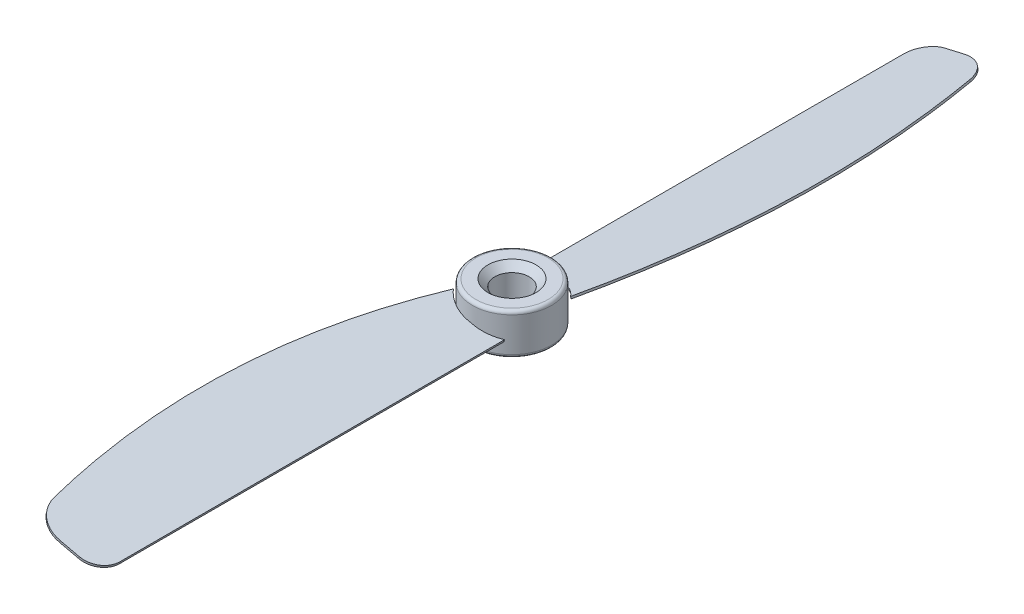
ISO-10303-21;
HEADER;
FILE_DESCRIPTION(('STEP AP214'),'2;1');
FILE_NAME('part.step','',(''),(''),'','','');
FILE_SCHEMA(('AUTOMOTIVE_DESIGN { 1 0 10303 214 1 1 1 1 }'));
ENDSEC;
DATA;
#1=APPLICATION_CONTEXT('core data for automotive mechanical design processes');
#2=APPLICATION_PROTOCOL_DEFINITION('international standard','automotive_design',2000,#1);
#3=PRODUCT_CONTEXT('',#1,'mechanical');
#4=PRODUCT('Part','Part','',(#3));
#5=PRODUCT_RELATED_PRODUCT_CATEGORY('part','',(#4));
#6=PRODUCT_DEFINITION_FORMATION('','',#4);
#7=PRODUCT_DEFINITION_CONTEXT('part definition',#1,'design');
#8=PRODUCT_DEFINITION('design','',#6,#7);
#9=PRODUCT_DEFINITION_SHAPE('','',#8);
#10=(LENGTH_UNIT() NAMED_UNIT(*) SI_UNIT(.MILLI.,.METRE.));
#11=(NAMED_UNIT(*) PLANE_ANGLE_UNIT() SI_UNIT($,.RADIAN.));
#12=(NAMED_UNIT(*) SI_UNIT($,.STERADIAN.) SOLID_ANGLE_UNIT());
#13=UNCERTAINTY_MEASURE_WITH_UNIT(LENGTH_MEASURE(1.E-05),#10,'distance_accuracy_value','');
#14=(GEOMETRIC_REPRESENTATION_CONTEXT(3) GLOBAL_UNCERTAINTY_ASSIGNED_CONTEXT((#13)) GLOBAL_UNIT_ASSIGNED_CONTEXT((#10,
#11,#12)) REPRESENTATION_CONTEXT('',''));
#15=CARTESIAN_POINT('',(0.,0.,0.));
#16=DIRECTION('',(0.,0.,1.));
#17=DIRECTION('',(1.,0.,0.));
#18=AXIS2_PLACEMENT_3D('',#15,#16,#17);
#19=CARTESIAN_POINT('',(0.,3.,0.));
#20=DIRECTION('',(0.,-1.,0.));
#21=DIRECTION('',(0.,0.,-1.));
#22=AXIS2_PLACEMENT_3D('',#19,#20,#21);
#23=CYLINDRICAL_SURFACE('',#22,5.75);
#24=CARTESIAN_POINT('',(0.,-2.5,0.));
#25=DIRECTION('',(0.,1.,0.));
#26=DIRECTION('',(0.,0.,1.));
#27=AXIS2_PLACEMENT_3D('',#24,#25,#26);
#28=CIRCLE('',#27,5.75);
#29=CARTESIAN_POINT('',(0.,-2.5,5.75));
#30=VERTEX_POINT('',#29);
#31=EDGE_CURVE('E335',#30,#30,#28,.T.);
#32=ORIENTED_EDGE('',*,*,#31,.T.);
#33=EDGE_LOOP('',(#32));
#34=FACE_BOUND('',#33,.T.);
#35=CARTESIAN_POINT('',(0.,2.5,0.));
#36=DIRECTION('',(0.,1.,0.));
#37=DIRECTION('',(0.,0.,1.));
#38=AXIS2_PLACEMENT_3D('',#35,#36,#37);
#39=CIRCLE('',#38,5.75);
#40=CARTESIAN_POINT('',(0.,2.5,5.75));
#41=VERTEX_POINT('',#40);
#42=EDGE_CURVE('E331',#41,#41,#39,.F.);
#43=ORIENTED_EDGE('',*,*,#42,.T.);
#44=EDGE_LOOP('',(#43));
#45=FACE_BOUND('',#44,.T.);
#46=CARTESIAN_POINT('',(0.,-15.7517323902207,0.));
#47=DIRECTION('',(0.974370064785235,0.224951054343866,0.));
#48=DIRECTION('',(0.224951054343866,-0.974370064785235,0.));
#49=AXIS2_PLACEMENT_3D('',#46,#47,#48);
#50=ELLIPSE('',#49,25.5611160248683,5.75);
#51=CARTESIAN_POINT('',(-3.41880983775629,-0.943240059214085,-4.6232282328759));
#52=VERTEX_POINT('',#51);
#53=CARTESIAN_POINT('',(-3.48629515405945,-0.650929039778514,-4.57255356434253));
#54=VERTEX_POINT('',#53);
#55=EDGE_CURVE('E69',#52,#54,#50,.T.);
#56=ORIENTED_EDGE('',*,*,#55,.F.);
#57=CARTESIAN_POINT('',(0.,-0.153945616169009,0.));
#58=DIRECTION('',(0.224951054343866,-0.974370064785235,0.));
#59=DIRECTION('',(-0.974370064785235,-0.224951054343866,0.));
#60=AXIS2_PLACEMENT_3D('',#57,#58,#59);
#61=ELLIPSE('',#60,5.901248619812,5.75);
#62=CARTESIAN_POINT('',(0.354622157582455,-0.0720746401149025,-5.73905420129055));
#63=VERTEX_POINT('',#62);
#64=EDGE_CURVE('E64',#52,#63,#61,.T.);
#65=ORIENTED_EDGE('',*,*,#64,.T.);
#66=CARTESIAN_POINT('',(0.354622157582455,-0.0720746401149025,-5.73905420129055));
#67=CARTESIAN_POINT('',(0.348852411202001,-0.0220916056182409,-5.73941071685678));
#68=CARTESIAN_POINT('',(0.343082658076224,0.0278914873125843,-5.7397585033949));
#69=CARTESIAN_POINT('',(0.331543138334024,0.127857790042562,-5.74043661841496));
#70=CARTESIAN_POINT('',(0.325773371717602,0.177840999841714,-5.74076694689688));
#71=CARTESIAN_POINT('',(0.320003598355857,0.227824268075029,-5.74108854635071));
#72=B_SPLINE_CURVE_WITH_KNOTS('',3,(#66,#67,#68,#69,#70,#71),.UNSPECIFIED.,.F.,.F.,(4,2,4),(0.,
0.150948617979298,0.301897235958597),.UNSPECIFIED.);
#73=CARTESIAN_POINT('',(0.320003598355995,0.227824268075136,-5.74108854635071));
#74=VERTEX_POINT('',#73);
#75=EDGE_CURVE('E154',#63,#74,#72,.T.);
#76=ORIENTED_EDGE('',*,*,#75,.T.);
#77=CARTESIAN_POINT('',(0.,0.153945616169009,0.));
#78=DIRECTION('',(0.224951054343866,-0.974370064785235,0.));
#79=DIRECTION('',(-0.974370064785235,-0.224951054343866,0.));
#80=AXIS2_PLACEMENT_3D('',#77,#78,#79);
#81=ELLIPSE('',#80,5.901248619812,5.75);
#82=EDGE_CURVE('E395',#54,#74,#81,.T.);
#83=ORIENTED_EDGE('',*,*,#82,.F.);
#84=EDGE_LOOP('',(#56,#65,#76,#83));
#85=FACE_BOUND('',#84,.T.);
#86=CARTESIAN_POINT('',(0.,-15.7517323902207,0.));
#87=DIRECTION('',(-0.974370064785235,0.224951054343866,0.));
#88=DIRECTION('',(-0.224951054343866,-0.974370064785235,0.));
#89=AXIS2_PLACEMENT_3D('',#86,#87,#88);
#90=ELLIPSE('',#89,25.5611160248683,5.75);
#91=CARTESIAN_POINT('',(3.41880983775629,-0.943240059214085,4.6232282328759));
#92=VERTEX_POINT('',#91);
#93=CARTESIAN_POINT('',(3.48629515405945,-0.650929039778514,4.57255356434253));
#94=VERTEX_POINT('',#93);
#95=EDGE_CURVE('E299',#92,#94,#90,.T.);
#96=ORIENTED_EDGE('',*,*,#95,.F.);
#97=CARTESIAN_POINT('',(0.,-0.153945616169009,0.));
#98=DIRECTION('',(-0.224951054343866,-0.974370064785235,0.));
#99=DIRECTION('',(0.974370064785235,-0.224951054343866,0.));
#100=AXIS2_PLACEMENT_3D('',#97,#98,#99);
#101=ELLIPSE('',#100,5.901248619812,5.75);
#102=CARTESIAN_POINT('',(-0.354622157582455,-0.0720746401149025,5.73905420129055));
#103=VERTEX_POINT('',#102);
#104=EDGE_CURVE('E310',#92,#103,#101,.T.);
#105=ORIENTED_EDGE('',*,*,#104,.T.);
#106=CARTESIAN_POINT('',(-0.354622157582455,-0.0720746401149025,5.73905420129055));
#107=CARTESIAN_POINT('',(-0.348852411202001,-0.0220916056182409,5.73941071685678));
#108=CARTESIAN_POINT('',(-0.343082658076224,0.0278914873125843,5.7397585033949));
#109=CARTESIAN_POINT('',(-0.331543138334024,0.127857790042562,5.74043661841496));
#110=CARTESIAN_POINT('',(-0.325773371717602,0.177840999841714,5.74076694689688));
#111=CARTESIAN_POINT('',(-0.320003598355857,0.227824268075029,5.74108854635071));
#112=B_SPLINE_CURVE_WITH_KNOTS('',3,(#106,#107,#108,#109,#110,#111),.UNSPECIFIED.,.F.,.F.,(4,2,
4),(0.,0.150948617979298,0.301897235958597),.UNSPECIFIED.);
#113=CARTESIAN_POINT('',(-0.320003598355995,0.227824268075136,5.74108854635071));
#114=VERTEX_POINT('',#113);
#115=EDGE_CURVE('E302',#103,#114,#112,.T.);
#116=ORIENTED_EDGE('',*,*,#115,.T.);
#117=CARTESIAN_POINT('',(0.,0.153945616169009,0.));
#118=DIRECTION('',(-0.224951054343866,-0.974370064785235,0.));
#119=DIRECTION('',(0.974370064785235,-0.224951054343866,0.));
#120=AXIS2_PLACEMENT_3D('',#117,#118,#119);
#121=ELLIPSE('',#120,5.901248619812,5.75);
#122=EDGE_CURVE('E295',#94,#114,#121,.T.);
#123=ORIENTED_EDGE('',*,*,#122,.F.);
#124=EDGE_LOOP('',(#96,#105,#116,#123));
#125=FACE_BOUND('',#124,.T.);
#126=ADVANCED_FACE('F47',(#34,#45,#85,#125),#23,.T.);
#127=CARTESIAN_POINT('',(0.,3.,0.));
#128=DIRECTION('',(0.,1.,0.));
#129=DIRECTION('',(0.,0.,1.));
#130=AXIS2_PLACEMENT_3D('',#127,#128,#129);
#131=PLANE('',#130);
#132=CARTESIAN_POINT('',(0.,3.,0.));
#133=DIRECTION('',(0.,1.,0.));
#134=DIRECTION('',(0.,0.,1.));
#135=AXIS2_PLACEMENT_3D('',#132,#133,#134);
#136=CIRCLE('',#135,3.50000000000002);
#137=CARTESIAN_POINT('',(0.,3.,3.50000000000002));
#138=VERTEX_POINT('',#137);
#139=EDGE_CURVE('E57',#138,#138,#136,.F.);
#140=ORIENTED_EDGE('',*,*,#139,.T.);
#141=EDGE_LOOP('',(#140));
#142=FACE_BOUND('',#141,.T.);
#143=CARTESIAN_POINT('',(0.,3.,0.));
#144=DIRECTION('',(0.,1.,0.));
#145=DIRECTION('',(0.,0.,1.));
#146=AXIS2_PLACEMENT_3D('',#143,#144,#145);
#147=CIRCLE('',#146,5.25);
#148=CARTESIAN_POINT('',(0.,3.,5.25));
#149=VERTEX_POINT('',#148);
#150=EDGE_CURVE('E343',#149,#149,#147,.T.);
#151=ORIENTED_EDGE('',*,*,#150,.T.);
#152=EDGE_LOOP('',(#151));
#153=FACE_BOUND('',#152,.T.);
#154=ADVANCED_FACE('F316',(#142,#153),#131,.T.);
#155=CARTESIAN_POINT('',(0.,-3.,0.));
#156=DIRECTION('',(0.,1.,0.));
#157=DIRECTION('',(0.,0.,1.));
#158=AXIS2_PLACEMENT_3D('',#155,#156,#157);
#159=PLANE('',#158);
#160=CARTESIAN_POINT('',(0.,-3.,0.));
#161=DIRECTION('',(0.,1.,0.));
#162=DIRECTION('',(0.,0.,1.));
#163=AXIS2_PLACEMENT_3D('',#160,#161,#162);
#164=CIRCLE('',#163,3.5);
#165=CARTESIAN_POINT('',(0.,-3.,3.5));
#166=VERTEX_POINT('',#165);
#167=EDGE_CURVE('E11',#166,#166,#164,.T.);
#168=ORIENTED_EDGE('',*,*,#167,.T.);
#169=EDGE_LOOP('',(#168));
#170=FACE_BOUND('',#169,.T.);
#171=CARTESIAN_POINT('',(0.,-3.,0.));
#172=DIRECTION('',(0.,1.,0.));
#173=DIRECTION('',(0.,0.,1.));
#174=AXIS2_PLACEMENT_3D('',#171,#172,#173);
#175=CIRCLE('',#174,5.25);
#176=CARTESIAN_POINT('',(0.,-3.,5.25));
#177=VERTEX_POINT('',#176);
#178=EDGE_CURVE('E339',#177,#177,#175,.F.);
#179=ORIENTED_EDGE('',*,*,#178,.T.);
#180=EDGE_LOOP('',(#179));
#181=FACE_BOUND('',#180,.T.);
#182=ADVANCED_FACE('F226',(#170,#181),#159,.F.);
#183=CARTESIAN_POINT('',(-0.691299378335197,0.00565342083347212,0.));
#184=DIRECTION('',(-0.224951054343866,-0.974370064785235,0.));
#185=DIRECTION('',(0.,0.,1.));
#186=AXIS2_PLACEMENT_3D('',#183,#184,#185);
#187=ELLIPSE('',#186,5.75,5.6026278725151);
#188=DIRECTION('',(0.224951054343866,0.974370064785235,0.));
#189=VECTOR('',#188,1.);
#190=SURFACE_OF_LINEAR_EXTRUSION('',#187,#189);
#191=ORIENTED_EDGE('',*,*,#115,.F.);
#192=CARTESIAN_POINT('',(-4.80140859442668,0.954546900881022,3.78427181784123));
#193=VERTEX_POINT('',#192);
#194=EDGE_CURVE('E231',#103,#193,#187,.T.);
#195=ORIENTED_EDGE('',*,*,#194,.T.);
#196=DIRECTION('',(0.224951054343866,0.974370064785235,0.));
#197=VECTOR('',#196,1.);
#198=CARTESIAN_POINT('',(-4.80140859442668,0.954546900881022,3.78427181784123));
#199=LINE('',#198,#197);
#200=CARTESIAN_POINT('',(-4.73392327812352,1.24685792031659,3.78427181784123));
#201=VERTEX_POINT('',#200);
#202=EDGE_CURVE('E291',#193,#201,#199,.T.);
#203=ORIENTED_EDGE('',*,*,#202,.T.);
#204=CARTESIAN_POINT('',(-0.623814062032037,0.297964440269043,0.));
#205=DIRECTION('',(-0.224951054343866,-0.974370064785235,0.));
#206=DIRECTION('',(0.,0.,1.));
#207=AXIS2_PLACEMENT_3D('',#204,#205,#206);
#208=ELLIPSE('',#207,5.75,5.6026278725151);
#209=EDGE_CURVE('E258',#114,#201,#208,.T.);
#210=ORIENTED_EDGE('',*,*,#209,.F.);
#211=EDGE_LOOP('',(#191,#195,#203,#210));
#212=FACE_BOUND('',#211,.T.);
#213=ADVANCED_FACE('F221',(#212),#190,.T.);
#214=CARTESIAN_POINT('',(-4.80140859442668,0.954546900881022,3.78427181784123));
#215=CARTESIAN_POINT('',(-10.4162492318675,2.2508350023053,21.7345231132644));
#216=CARTESIAN_POINT('',(-11.1802916614812,2.42722809597338,40.3867796730556));
#217=CARTESIAN_POINT('',(-7.05891565441567,1.47573347227387,59.5762738587111));
#218=B_SPLINE_CURVE_WITH_KNOTS('',3,(#214,#215,#216,#217),.UNSPECIFIED.,.F.,.F.,(4,4),(0.,
0.936316623579652),.UNSPECIFIED.);
#219=DIRECTION('',(0.224951054343866,0.974370064785235,0.));
#220=VECTOR('',#219,1.);
#221=SURFACE_OF_LINEAR_EXTRUSION('',#218,#220);
#222=CARTESIAN_POINT('',(-4.73392327812352,1.24685792031659,3.78427181784123));
#223=CARTESIAN_POINT('',(-10.3487639155644,2.54314602174087,21.7345231132644));
#224=CARTESIAN_POINT('',(-11.112806345178,2.71953911540895,40.3867796730556));
#225=CARTESIAN_POINT('',(-6.99143033811251,1.76804449170944,59.5762738587111));
#226=B_SPLINE_CURVE_WITH_KNOTS('',3,(#222,#223,#224,#225),.UNSPECIFIED.,.F.,.F.,(4,4),(0.,
0.936316623579652),.UNSPECIFIED.);
#227=CARTESIAN_POINT('',(-6.99143033811251,1.76804449170943,59.5762738587111));
#228=VERTEX_POINT('',#227);
#229=EDGE_CURVE('E168',#201,#228,#226,.T.);
#230=ORIENTED_EDGE('',*,*,#229,.F.);
#231=ORIENTED_EDGE('',*,*,#202,.F.);
#232=CARTESIAN_POINT('',(-7.05891565441567,1.47573347227386,59.5762738587111));
#233=VERTEX_POINT('',#232);
#234=EDGE_CURVE('E236',#193,#233,#218,.T.);
#235=ORIENTED_EDGE('',*,*,#234,.T.);
#236=DIRECTION('',(0.224951054343866,0.974370064785235,0.));
#237=VECTOR('',#236,1.);
#238=CARTESIAN_POINT('',(-7.05891565441567,1.47573347227386,59.5762738587111));
#239=LINE('',#238,#237);
#240=EDGE_CURVE('E252',#233,#228,#239,.T.);
#241=ORIENTED_EDGE('',*,*,#240,.T.);
#242=EDGE_LOOP('',(#230,#231,#235,#241));
#243=FACE_BOUND('',#242,.T.);
#244=ADVANCED_FACE('F219',(#243),#221,.T.);
#245=CARTESIAN_POINT('',(3.41880983775629,-0.943240059214085,0.));
#246=DIRECTION('',(-0.974370064785235,0.224951054343866,0.));
#247=DIRECTION('',(-0.224951054343866,-0.974370064785235,0.));
#248=AXIS2_PLACEMENT_3D('',#245,#246,#247);
#249=PLANE('',#248);
#250=DIRECTION('',(0.,0.,1.));
#251=VECTOR('',#250,1.);
#252=CARTESIAN_POINT('',(3.41880983775629,-0.943240059214085,0.));
#253=LINE('',#252,#251);
#254=CARTESIAN_POINT('',(3.41880983775629,-0.943240059214083,60.5));
#255=VERTEX_POINT('',#254);
#256=EDGE_CURVE('E235',#92,#255,#253,.T.);
#257=ORIENTED_EDGE('',*,*,#256,.F.);
#258=ORIENTED_EDGE('',*,*,#95,.T.);
#259=DIRECTION('',(0.,0.,1.));
#260=VECTOR('',#259,1.);
#261=CARTESIAN_POINT('',(3.48629515405945,-0.650929039778514,0.));
#262=LINE('',#261,#260);
#263=CARTESIAN_POINT('',(3.48629515405945,-0.650929039778513,60.5));
#264=VERTEX_POINT('',#263);
#265=EDGE_CURVE('E264',#94,#264,#262,.T.);
#266=ORIENTED_EDGE('',*,*,#265,.T.);
#267=DIRECTION('',(0.224951054343866,0.974370064785235,0.));
#268=VECTOR('',#267,1.);
#269=CARTESIAN_POINT('',(3.41880983775629,-0.943240059214083,60.5));
#270=LINE('',#269,#268);
#271=EDGE_CURVE('E287',#255,#264,#270,.T.);
#272=ORIENTED_EDGE('',*,*,#271,.F.);
#273=EDGE_LOOP('',(#257,#258,#266,#272));
#274=FACE_BOUND('',#273,.T.);
#275=ADVANCED_FACE('F215',(#274),#249,.F.);
#276=CARTESIAN_POINT('',(0.495699643400583,-0.26838689618249,60.5));
#277=DIRECTION('',(0.224951054343866,0.974370064785235,0.));
#278=DIRECTION('',(-0.974370064785235,0.224951054343866,0.));
#279=AXIS2_PLACEMENT_3D('',#276,#277,#278);
#280=CYLINDRICAL_SURFACE('',#279,3.);
#281=CARTESIAN_POINT('',(0.563184959703743,0.0239241232530808,60.5));
#282=DIRECTION('',(-0.224951054343866,-0.974370064785235,0.));
#283=DIRECTION('',(0.974370064785235,-0.224951054343866,0.));
#284=AXIS2_PLACEMENT_3D('',#281,#282,#283);
#285=CIRCLE('',#284,3.);
#286=CARTESIAN_POINT('',(0.563184959703723,0.0239241232530918,63.5));
#287=VERTEX_POINT('',#286);
#288=EDGE_CURVE('E267',#264,#287,#285,.T.);
#289=ORIENTED_EDGE('',*,*,#288,.T.);
#290=DIRECTION('',(0.224951054343866,0.974370064785235,0.));
#291=VECTOR('',#290,1.);
#292=CARTESIAN_POINT('',(0.495699643400564,-0.268386896182479,63.5));
#293=LINE('',#292,#291);
#294=CARTESIAN_POINT('',(0.495699643400564,-0.268386896182479,63.5));
#295=VERTEX_POINT('',#294);
#296=EDGE_CURVE('E283',#295,#287,#293,.T.);
#297=ORIENTED_EDGE('',*,*,#296,.F.);
#298=CARTESIAN_POINT('',(0.495699643400583,-0.26838689618249,60.5));
#299=DIRECTION('',(-0.224951054343866,-0.974370064785235,0.));
#300=DIRECTION('',(0.974370064785235,-0.224951054343866,0.));
#301=AXIS2_PLACEMENT_3D('',#298,#299,#300);
#302=CIRCLE('',#301,3.);
#303=EDGE_CURVE('E242',#255,#295,#302,.T.);
#304=ORIENTED_EDGE('',*,*,#303,.F.);
#305=ORIENTED_EDGE('',*,*,#271,.T.);
#306=EDGE_LOOP('',(#289,#297,#304,#305));
#307=FACE_BOUND('',#306,.T.);
#308=ADVANCED_FACE('F211',(#307),#280,.T.);
#309=CARTESIAN_POINT('',(-0.0337426581515794,-0.146155509717783,63.5));
#310=DIRECTION('',(0.,0.,-1.));
#311=DIRECTION('',(-1.,0.,0.));
#312=AXIS2_PLACEMENT_3D('',#309,#310,#311);
#313=PLANE('',#312);
#314=DIRECTION('',(-0.974370064785235,0.224951054343866,0.));
#315=VECTOR('',#314,1.);
#316=CARTESIAN_POINT('',(0.0337426581515803,0.146155509717787,63.5));
#317=LINE('',#316,#315);
#318=CARTESIAN_POINT('',(-2.23378628897707,0.669655816066236,63.5));
#319=VERTEX_POINT('',#318);
#320=EDGE_CURVE('E270',#287,#319,#317,.T.);
#321=ORIENTED_EDGE('',*,*,#320,.T.);
#322=DIRECTION('',(0.224951054343866,0.974370064785235,0.));
#323=VECTOR('',#322,1.);
#324=CARTESIAN_POINT('',(-2.30127160528023,0.377344796630665,63.5));
#325=LINE('',#324,#323);
#326=CARTESIAN_POINT('',(-2.30127160528023,0.377344796630665,63.5));
#327=VERTEX_POINT('',#326);
#328=EDGE_CURVE('E280',#327,#319,#325,.T.);
#329=ORIENTED_EDGE('',*,*,#328,.F.);
#330=DIRECTION('',(-0.974370064785235,0.224951054343866,0.));
#331=VECTOR('',#330,1.);
#332=CARTESIAN_POINT('',(-0.0337426581515794,-0.146155509717783,63.5));
#333=LINE('',#332,#331);
#334=EDGE_CURVE('E245',#295,#327,#333,.T.);
#335=ORIENTED_EDGE('',*,*,#334,.F.);
#336=ORIENTED_EDGE('',*,*,#296,.T.);
#337=EDGE_LOOP('',(#321,#329,#335,#336));
#338=FACE_BOUND('',#337,.T.);
#339=ADVANCED_FACE('F207',(#338),#313,.F.);
#340=CARTESIAN_POINT('',(-2.30127160528023,0.377344796630658,58.5));
#341=DIRECTION('',(0.224951054343866,0.974370064785235,0.));
#342=DIRECTION('',(-0.974370064785235,0.224951054343866,0.));
#343=AXIS2_PLACEMENT_3D('',#340,#341,#342);
#344=CYLINDRICAL_SURFACE('',#343,5.);
#345=CARTESIAN_POINT('',(-2.23378628897707,0.669655816066228,58.5));
#346=DIRECTION('',(-0.224951054343866,-0.974370064785235,0.));
#347=DIRECTION('',(0.974370064785235,-0.224951054343866,0.));
#348=AXIS2_PLACEMENT_3D('',#345,#346,#347);
#349=CIRCLE('',#348,5.);
#350=EDGE_CURVE('E274',#228,#319,#349,.F.);
#351=ORIENTED_EDGE('',*,*,#350,.F.);
#352=ORIENTED_EDGE('',*,*,#240,.F.);
#353=CARTESIAN_POINT('',(-2.30127160528023,0.377344796630658,58.5));
#354=DIRECTION('',(-0.224951054343866,-0.974370064785235,0.));
#355=DIRECTION('',(0.974370064785235,-0.224951054343866,0.));
#356=AXIS2_PLACEMENT_3D('',#353,#354,#355);
#357=CIRCLE('',#356,5.);
#358=EDGE_CURVE('E248',#233,#327,#357,.F.);
#359=ORIENTED_EDGE('',*,*,#358,.T.);
#360=ORIENTED_EDGE('',*,*,#328,.T.);
#361=EDGE_LOOP('',(#351,#352,#359,#360));
#362=FACE_BOUND('',#361,.T.);
#363=ADVANCED_FACE('F200',(#362),#344,.T.);
#364=CARTESIAN_POINT('',(-0.0337426581515798,-0.146155509717785,0.));
#365=DIRECTION('',(-0.224951054343866,-0.974370064785235,0.));
#366=DIRECTION('',(0.974370064785235,-0.224951054343866,0.));
#367=AXIS2_PLACEMENT_3D('',#364,#365,#366);
#368=PLANE('',#367);
#369=ORIENTED_EDGE('',*,*,#104,.F.);
#370=ORIENTED_EDGE('',*,*,#256,.T.);
#371=ORIENTED_EDGE('',*,*,#303,.T.);
#372=ORIENTED_EDGE('',*,*,#334,.T.);
#373=ORIENTED_EDGE('',*,*,#358,.F.);
#374=ORIENTED_EDGE('',*,*,#234,.F.);
#375=ORIENTED_EDGE('',*,*,#194,.F.);
#376=EDGE_LOOP('',(#369,#370,#371,#372,#373,#374,#375));
#377=FACE_BOUND('',#376,.T.);
#378=ADVANCED_FACE('F196',(#377),#368,.T.);
#379=CARTESIAN_POINT('',(0.0337426581515799,0.146155509717786,0.));
#380=DIRECTION('',(-0.224951054343866,-0.974370064785235,0.));
#381=DIRECTION('',(0.974370064785235,-0.224951054343866,0.));
#382=AXIS2_PLACEMENT_3D('',#379,#380,#381);
#383=PLANE('',#382);
#384=ORIENTED_EDGE('',*,*,#265,.F.);
#385=ORIENTED_EDGE('',*,*,#122,.T.);
#386=ORIENTED_EDGE('',*,*,#209,.T.);
#387=ORIENTED_EDGE('',*,*,#229,.T.);
#388=ORIENTED_EDGE('',*,*,#350,.T.);
#389=ORIENTED_EDGE('',*,*,#320,.F.);
#390=ORIENTED_EDGE('',*,*,#288,.F.);
#391=EDGE_LOOP('',(#384,#385,#386,#387,#388,#389,#390));
#392=FACE_BOUND('',#391,.T.);
#393=ADVANCED_FACE('F199',(#392),#383,.F.);
#394=CARTESIAN_POINT('',(0.691299378335197,0.00565342083347212,0.));
#395=DIRECTION('',(0.224951054343866,-0.974370064785235,0.));
#396=DIRECTION('',(0.,0.,-1.));
#397=AXIS2_PLACEMENT_3D('',#394,#395,#396);
#398=ELLIPSE('',#397,5.75,5.6026278725151);
#399=DIRECTION('',(-0.224951054343866,0.974370064785235,0.));
#400=VECTOR('',#399,1.);
#401=SURFACE_OF_LINEAR_EXTRUSION('',#398,#400);
#402=ORIENTED_EDGE('',*,*,#75,.F.);
#403=CARTESIAN_POINT('',(4.80140859442668,0.954546900881022,-3.78427181784123));
#404=VERTEX_POINT('',#403);
#405=EDGE_CURVE('E148',#63,#404,#398,.T.);
#406=ORIENTED_EDGE('',*,*,#405,.T.);
#407=DIRECTION('',(-0.224951054343866,0.974370064785235,0.));
#408=VECTOR('',#407,1.);
#409=CARTESIAN_POINT('',(4.80140859442668,0.954546900881022,-3.78427181784123));
#410=LINE('',#409,#408);
#411=CARTESIAN_POINT('',(4.73392327812352,1.24685792031659,-3.78427181784123));
#412=VERTEX_POINT('',#411);
#413=EDGE_CURVE('E152',#404,#412,#410,.T.);
#414=ORIENTED_EDGE('',*,*,#413,.T.);
#415=CARTESIAN_POINT('',(0.623814062032037,0.297964440269043,0.));
#416=DIRECTION('',(0.224951054343866,-0.974370064785235,0.));
#417=DIRECTION('',(0.,0.,-1.));
#418=AXIS2_PLACEMENT_3D('',#415,#416,#417);
#419=ELLIPSE('',#418,5.75,5.6026278725151);
#420=EDGE_CURVE('E438',#74,#412,#419,.T.);
#421=ORIENTED_EDGE('',*,*,#420,.F.);
#422=EDGE_LOOP('',(#402,#406,#414,#421));
#423=FACE_BOUND('',#422,.T.);
#424=ADVANCED_FACE('F150',(#423),#401,.T.);
#425=CARTESIAN_POINT('',(4.80140859442668,0.954546900881022,-3.78427181784123));
#426=CARTESIAN_POINT('',(10.4162492318675,2.2508350023053,-21.7345231132644));
#427=CARTESIAN_POINT('',(11.1802916614812,2.42722809597338,-40.3867796730556));
#428=CARTESIAN_POINT('',(7.05891565441567,1.47573347227387,-59.5762738587111));
#429=B_SPLINE_CURVE_WITH_KNOTS('',3,(#425,#426,#427,#428),.UNSPECIFIED.,.F.,.F.,(4,4),(0.,
0.936316623579652),.UNSPECIFIED.);
#430=DIRECTION('',(-0.224951054343866,0.974370064785235,0.));
#431=VECTOR('',#430,1.);
#432=SURFACE_OF_LINEAR_EXTRUSION('',#429,#431);
#433=CARTESIAN_POINT('',(4.73392327812352,1.24685792031659,-3.78427181784123));
#434=CARTESIAN_POINT('',(10.3487639155644,2.54314602174087,-21.7345231132644));
#435=CARTESIAN_POINT('',(11.112806345178,2.71953911540895,-40.3867796730556));
#436=CARTESIAN_POINT('',(6.99143033811251,1.76804449170944,-59.5762738587111));
#437=B_SPLINE_CURVE_WITH_KNOTS('',3,(#433,#434,#435,#436),.UNSPECIFIED.,.F.,.F.,(4,4),(0.,
0.936316623579652),.UNSPECIFIED.);
#438=CARTESIAN_POINT('',(6.99143033811251,1.76804449170943,-59.5762738587111));
#439=VERTEX_POINT('',#438);
#440=EDGE_CURVE('E166',#412,#439,#437,.T.);
#441=ORIENTED_EDGE('',*,*,#440,.F.);
#442=ORIENTED_EDGE('',*,*,#413,.F.);
#443=CARTESIAN_POINT('',(7.05891565441567,1.47573347227386,-59.5762738587111));
#444=VERTEX_POINT('',#443);
#445=EDGE_CURVE('E159',#404,#444,#429,.T.);
#446=ORIENTED_EDGE('',*,*,#445,.T.);
#447=DIRECTION('',(-0.224951054343866,0.974370064785235,0.));
#448=VECTOR('',#447,1.);
#449=CARTESIAN_POINT('',(7.05891565441567,1.47573347227386,-59.5762738587111));
#450=LINE('',#449,#448);
#451=EDGE_CURVE('E419',#444,#439,#450,.T.);
#452=ORIENTED_EDGE('',*,*,#451,.T.);
#453=EDGE_LOOP('',(#441,#442,#446,#452));
#454=FACE_BOUND('',#453,.T.);
#455=ADVANCED_FACE('F163',(#454),#432,.T.);
#456=CARTESIAN_POINT('',(-3.41880983775629,-0.943240059214085,0.));
#457=DIRECTION('',(0.974370064785235,0.224951054343866,0.));
#458=DIRECTION('',(-0.224951054343866,0.974370064785235,0.));
#459=AXIS2_PLACEMENT_3D('',#456,#457,#458);
#460=PLANE('',#459);
#461=DIRECTION('',(0.,0.,-1.));
#462=VECTOR('',#461,1.);
#463=CARTESIAN_POINT('',(-3.41880983775629,-0.943240059214085,0.));
#464=LINE('',#463,#462);
#465=CARTESIAN_POINT('',(-3.41880983775629,-0.943240059214083,-60.5));
#466=VERTEX_POINT('',#465);
#467=EDGE_CURVE('E158',#52,#466,#464,.T.);
#468=ORIENTED_EDGE('',*,*,#467,.F.);
#469=ORIENTED_EDGE('',*,*,#55,.T.);
#470=DIRECTION('',(0.,0.,-1.));
#471=VECTOR('',#470,1.);
#472=CARTESIAN_POINT('',(-3.48629515405945,-0.650929039778514,0.));
#473=LINE('',#472,#471);
#474=CARTESIAN_POINT('',(-3.48629515405945,-0.650929039778513,-60.5));
#475=VERTEX_POINT('',#474);
#476=EDGE_CURVE('E444',#54,#475,#473,.T.);
#477=ORIENTED_EDGE('',*,*,#476,.T.);
#478=DIRECTION('',(-0.224951054343866,0.974370064785235,0.));
#479=VECTOR('',#478,1.);
#480=CARTESIAN_POINT('',(-3.41880983775629,-0.943240059214083,-60.5));
#481=LINE('',#480,#479);
#482=EDGE_CURVE('E169',#466,#475,#481,.T.);
#483=ORIENTED_EDGE('',*,*,#482,.F.);
#484=EDGE_LOOP('',(#468,#469,#477,#483));
#485=FACE_BOUND('',#484,.T.);
#486=ADVANCED_FACE('F193',(#485),#460,.F.);
#487=CARTESIAN_POINT('',(-0.495699643400583,-0.26838689618249,-60.5));
#488=DIRECTION('',(-0.224951054343866,0.974370064785235,0.));
#489=DIRECTION('',(-0.974370064785235,-0.224951054343866,0.));
#490=AXIS2_PLACEMENT_3D('',#487,#488,#489);
#491=CYLINDRICAL_SURFACE('',#490,3.);
#492=CARTESIAN_POINT('',(-0.563184959703743,0.0239241232530808,-60.5));
#493=DIRECTION('',(0.224951054343866,-0.974370064785235,0.));
#494=DIRECTION('',(-0.974370064785235,-0.224951054343866,0.));
#495=AXIS2_PLACEMENT_3D('',#492,#493,#494);
#496=CIRCLE('',#495,3.);
#497=CARTESIAN_POINT('',(-0.563184959703723,0.0239241232530918,-63.5));
#498=VERTEX_POINT('',#497);
#499=EDGE_CURVE('E447',#475,#498,#496,.T.);
#500=ORIENTED_EDGE('',*,*,#499,.T.);
#501=DIRECTION('',(-0.224951054343866,0.974370064785235,0.));
#502=VECTOR('',#501,1.);
#503=CARTESIAN_POINT('',(-0.495699643400564,-0.268386896182479,-63.5));
#504=LINE('',#503,#502);
#505=CARTESIAN_POINT('',(-0.495699643400564,-0.268386896182479,-63.5));
#506=VERTEX_POINT('',#505);
#507=EDGE_CURVE('E412',#506,#498,#504,.T.);
#508=ORIENTED_EDGE('',*,*,#507,.F.);
#509=CARTESIAN_POINT('',(-0.495699643400583,-0.26838689618249,-60.5));
#510=DIRECTION('',(0.224951054343866,-0.974370064785235,0.));
#511=DIRECTION('',(-0.974370064785235,-0.224951054343866,0.));
#512=AXIS2_PLACEMENT_3D('',#509,#510,#511);
#513=CIRCLE('',#512,3.);
#514=EDGE_CURVE('E427',#466,#506,#513,.T.);
#515=ORIENTED_EDGE('',*,*,#514,.F.);
#516=ORIENTED_EDGE('',*,*,#482,.T.);
#517=EDGE_LOOP('',(#500,#508,#515,#516));
#518=FACE_BOUND('',#517,.T.);
#519=ADVANCED_FACE('F471',(#518),#491,.T.);
#520=CARTESIAN_POINT('',(0.0337426581515794,-0.146155509717783,-63.5));
#521=DIRECTION('',(0.,0.,1.));
#522=DIRECTION('',(1.,0.,0.));
#523=AXIS2_PLACEMENT_3D('',#520,#521,#522);
#524=PLANE('',#523);
#525=DIRECTION('',(0.974370064785235,0.224951054343866,0.));
#526=VECTOR('',#525,1.);
#527=CARTESIAN_POINT('',(-0.0337426581515803,0.146155509717787,-63.5));
#528=LINE('',#527,#526);
#529=CARTESIAN_POINT('',(2.23378628897707,0.669655816066236,-63.5));
#530=VERTEX_POINT('',#529);
#531=EDGE_CURVE('E179',#498,#530,#528,.T.);
#532=ORIENTED_EDGE('',*,*,#531,.T.);
#533=DIRECTION('',(-0.224951054343866,0.974370064785235,0.));
#534=VECTOR('',#533,1.);
#535=CARTESIAN_POINT('',(2.30127160528023,0.377344796630665,-63.5));
#536=LINE('',#535,#534);
#537=CARTESIAN_POINT('',(2.30127160528023,0.377344796630665,-63.5));
#538=VERTEX_POINT('',#537);
#539=EDGE_CURVE('E416',#538,#530,#536,.T.);
#540=ORIENTED_EDGE('',*,*,#539,.F.);
#541=DIRECTION('',(0.974370064785235,0.224951054343866,0.));
#542=VECTOR('',#541,1.);
#543=CARTESIAN_POINT('',(0.0337426581515794,-0.146155509717783,-63.5));
#544=LINE('',#543,#542);
#545=EDGE_CURVE('E424',#506,#538,#544,.T.);
#546=ORIENTED_EDGE('',*,*,#545,.F.);
#547=ORIENTED_EDGE('',*,*,#507,.T.);
#548=EDGE_LOOP('',(#532,#540,#546,#547));
#549=FACE_BOUND('',#548,.T.);
#550=ADVANCED_FACE('F455',(#549),#524,.F.);
#551=CARTESIAN_POINT('',(2.30127160528023,0.377344796630658,-58.5));
#552=DIRECTION('',(-0.224951054343866,0.974370064785235,0.));
#553=DIRECTION('',(-0.974370064785235,-0.224951054343866,0.));
#554=AXIS2_PLACEMENT_3D('',#551,#552,#553);
#555=CYLINDRICAL_SURFACE('',#554,5.);
#556=CARTESIAN_POINT('',(2.23378628897707,0.669655816066228,-58.5));
#557=DIRECTION('',(0.224951054343866,-0.974370064785235,0.));
#558=DIRECTION('',(-0.974370064785235,-0.224951054343866,0.));
#559=AXIS2_PLACEMENT_3D('',#556,#557,#558);
#560=CIRCLE('',#559,5.);
#561=EDGE_CURVE('E175',#439,#530,#560,.F.);
#562=ORIENTED_EDGE('',*,*,#561,.F.);
#563=ORIENTED_EDGE('',*,*,#451,.F.);
#564=CARTESIAN_POINT('',(2.30127160528023,0.377344796630658,-58.5));
#565=DIRECTION('',(0.224951054343866,-0.974370064785235,0.));
#566=DIRECTION('',(-0.974370064785235,-0.224951054343866,0.));
#567=AXIS2_PLACEMENT_3D('',#564,#565,#566);
#568=CIRCLE('',#567,5.);
#569=EDGE_CURVE('E173',#444,#538,#568,.F.);
#570=ORIENTED_EDGE('',*,*,#569,.T.);
#571=ORIENTED_EDGE('',*,*,#539,.T.);
#572=EDGE_LOOP('',(#562,#563,#570,#571));
#573=FACE_BOUND('',#572,.T.);
#574=ADVANCED_FACE('F463',(#573),#555,.T.);
#575=CARTESIAN_POINT('',(0.0337426581515798,-0.146155509717785,0.));
#576=DIRECTION('',(0.224951054343866,-0.974370064785235,0.));
#577=DIRECTION('',(-0.974370064785235,-0.224951054343866,0.));
#578=AXIS2_PLACEMENT_3D('',#575,#576,#577);
#579=PLANE('',#578);
#580=ORIENTED_EDGE('',*,*,#64,.F.);
#581=ORIENTED_EDGE('',*,*,#467,.T.);
#582=ORIENTED_EDGE('',*,*,#514,.T.);
#583=ORIENTED_EDGE('',*,*,#545,.T.);
#584=ORIENTED_EDGE('',*,*,#569,.F.);
#585=ORIENTED_EDGE('',*,*,#445,.F.);
#586=ORIENTED_EDGE('',*,*,#405,.F.);
#587=EDGE_LOOP('',(#580,#581,#582,#583,#584,#585,#586));
#588=FACE_BOUND('',#587,.T.);
#589=ADVANCED_FACE('F171',(#588),#579,.T.);
#590=CARTESIAN_POINT('',(-0.0337426581515799,0.146155509717786,0.));
#591=DIRECTION('',(0.224951054343866,-0.974370064785235,0.));
#592=DIRECTION('',(-0.974370064785235,-0.224951054343866,0.));
#593=AXIS2_PLACEMENT_3D('',#590,#591,#592);
#594=PLANE('',#593);
#595=ORIENTED_EDGE('',*,*,#476,.F.);
#596=ORIENTED_EDGE('',*,*,#82,.T.);
#597=ORIENTED_EDGE('',*,*,#420,.T.);
#598=ORIENTED_EDGE('',*,*,#440,.T.);
#599=ORIENTED_EDGE('',*,*,#561,.T.);
#600=ORIENTED_EDGE('',*,*,#531,.F.);
#601=ORIENTED_EDGE('',*,*,#499,.F.);
#602=EDGE_LOOP('',(#595,#596,#597,#598,#599,#600,#601));
#603=FACE_BOUND('',#602,.T.);
#604=ADVANCED_FACE('F369',(#603),#594,.F.);
#605=CARTESIAN_POINT('',(0.,-3.,0.));
#606=DIRECTION('',(0.,1.,0.));
#607=DIRECTION('',(0.,0.,1.));
#608=AXIS2_PLACEMENT_3D('',#605,#606,#607);
#609=CYLINDRICAL_SURFACE('',#608,2.5);
#610=CARTESIAN_POINT('',(0.,1.99999999999999,0.));
#611=DIRECTION('',(0.,1.,0.));
#612=DIRECTION('',(0.,0.,1.));
#613=AXIS2_PLACEMENT_3D('',#610,#611,#612);
#614=CIRCLE('',#613,2.5);
#615=CARTESIAN_POINT('',(0.,1.99999999999999,2.5));
#616=VERTEX_POINT('',#615);
#617=EDGE_CURVE('E351',#616,#616,#614,.T.);
#618=ORIENTED_EDGE('',*,*,#617,.T.);
#619=EDGE_LOOP('',(#618));
#620=FACE_BOUND('',#619,.T.);
#621=CARTESIAN_POINT('',(0.,-1.99999999999999,0.));
#622=DIRECTION('',(0.,1.,0.));
#623=DIRECTION('',(0.,0.,1.));
#624=AXIS2_PLACEMENT_3D('',#621,#622,#623);
#625=CIRCLE('',#624,2.5);
#626=CARTESIAN_POINT('',(0.,-1.99999999999999,2.5));
#627=VERTEX_POINT('',#626);
#628=EDGE_CURVE('E347',#627,#627,#625,.F.);
#629=ORIENTED_EDGE('',*,*,#628,.T.);
#630=EDGE_LOOP('',(#629));
#631=FACE_BOUND('',#630,.T.);
#632=ADVANCED_FACE('F366',(#620,#631),#609,.F.);
#633=CARTESIAN_POINT('',(0.,-2.5,0.));
#634=DIRECTION('',(0.,1.,0.));
#635=DIRECTION('',(0.,0.,1.));
#636=AXIS2_PLACEMENT_3D('',#633,#634,#635);
#637=TOROIDAL_SURFACE('',#636,5.25,0.5);
#638=ORIENTED_EDGE('',*,*,#178,.F.);
#639=EDGE_LOOP('',(#638));
#640=FACE_BOUND('',#639,.T.);
#641=ORIENTED_EDGE('',*,*,#31,.F.);
#642=EDGE_LOOP('',(#641));
#643=FACE_BOUND('',#642,.T.);
#644=ADVANCED_FACE('F318',(#640,#643),#637,.T.);
#645=CARTESIAN_POINT('',(0.,2.5,0.));
#646=DIRECTION('',(0.,1.,0.));
#647=DIRECTION('',(0.,0.,1.));
#648=AXIS2_PLACEMENT_3D('',#645,#646,#647);
#649=TOROIDAL_SURFACE('',#648,5.25,0.5);
#650=ORIENTED_EDGE('',*,*,#42,.F.);
#651=EDGE_LOOP('',(#650));
#652=FACE_BOUND('',#651,.T.);
#653=ORIENTED_EDGE('',*,*,#150,.F.);
#654=EDGE_LOOP('',(#653));
#655=FACE_BOUND('',#654,.T.);
#656=ADVANCED_FACE('F363',(#652,#655),#649,.T.);
#657=CARTESIAN_POINT('',(0.,1.99999999999999,0.));
#658=DIRECTION('',(0.,1.,0.));
#659=DIRECTION('',(0.,0.,1.));
#660=AXIS2_PLACEMENT_3D('',#657,#658,#659);
#661=CONICAL_SURFACE('',#660,2.5,0.785398163397451);
#662=ORIENTED_EDGE('',*,*,#139,.F.);
#663=EDGE_LOOP('',(#662));
#664=FACE_BOUND('',#663,.T.);
#665=ORIENTED_EDGE('',*,*,#617,.F.);
#666=EDGE_LOOP('',(#665));
#667=FACE_BOUND('',#666,.T.);
#668=ADVANCED_FACE('F360',(#664,#667),#661,.F.);
#669=CARTESIAN_POINT('',(0.,-3.,0.));
#670=DIRECTION('',(0.,-1.,0.));
#671=DIRECTION('',(0.,0.,-1.));
#672=AXIS2_PLACEMENT_3D('',#669,#670,#671);
#673=CONICAL_SURFACE('',#672,3.5,0.785398163397446);
#674=ORIENTED_EDGE('',*,*,#628,.F.);
#675=EDGE_LOOP('',(#674));
#676=FACE_BOUND('',#675,.T.);
#677=ORIENTED_EDGE('',*,*,#167,.F.);
#678=EDGE_LOOP('',(#677));
#679=FACE_BOUND('',#678,.T.);
#680=ADVANCED_FACE('F50',(#676,#679),#673,.F.);
#681=CLOSED_SHELL('',(#126,#154,#182,#213,#244,#275,#308,#339,#363,#378,#393,#424,#455,#486,
#519,#550,#574,#589,#604,#632,#644,#656,#668,#680));
#682=MANIFOLD_SOLID_BREP('B2',#681);
#683=ADVANCED_BREP_SHAPE_REPRESENTATION('',(#18,#682),#14);
#684=SHAPE_DEFINITION_REPRESENTATION(#9,#683);
ENDSEC;
END-ISO-10303-21;
